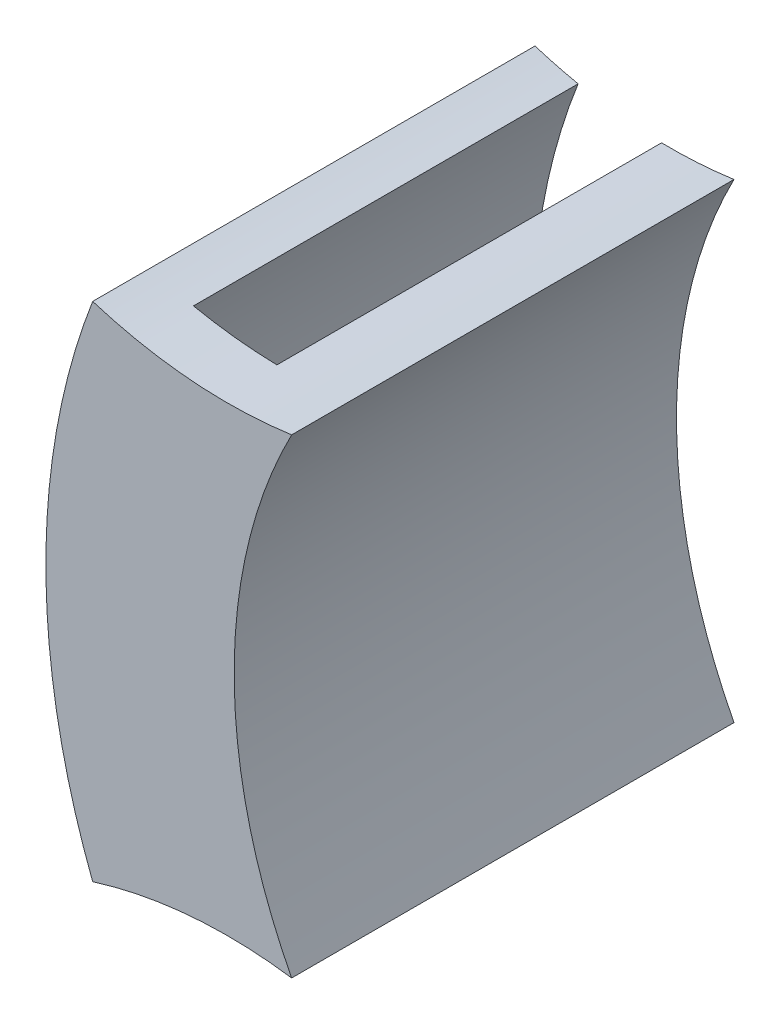
ISO-10303-21;
HEADER;
FILE_DESCRIPTION(('STEP AP214'),'2;1');
FILE_NAME('part.step','',(''),(''),'','','');
FILE_SCHEMA(('AUTOMOTIVE_DESIGN { 1 0 10303 214 1 1 1 1 }'));
ENDSEC;
DATA;
#1=APPLICATION_CONTEXT('core data for automotive mechanical design processes');
#2=APPLICATION_PROTOCOL_DEFINITION('international standard','automotive_design',2000,#1);
#3=PRODUCT_CONTEXT('',#1,'mechanical');
#4=PRODUCT('Part','Part','',(#3));
#5=PRODUCT_RELATED_PRODUCT_CATEGORY('part','',(#4));
#6=PRODUCT_DEFINITION_FORMATION('','',#4);
#7=PRODUCT_DEFINITION_CONTEXT('part definition',#1,'design');
#8=PRODUCT_DEFINITION('design','',#6,#7);
#9=PRODUCT_DEFINITION_SHAPE('','',#8);
#10=(LENGTH_UNIT() NAMED_UNIT(*) SI_UNIT(.MILLI.,.METRE.));
#11=(NAMED_UNIT(*) PLANE_ANGLE_UNIT() SI_UNIT($,.RADIAN.));
#12=(NAMED_UNIT(*) SI_UNIT($,.STERADIAN.) SOLID_ANGLE_UNIT());
#13=UNCERTAINTY_MEASURE_WITH_UNIT(LENGTH_MEASURE(1.E-05),#10,'distance_accuracy_value','');
#14=(GEOMETRIC_REPRESENTATION_CONTEXT(3) GLOBAL_UNCERTAINTY_ASSIGNED_CONTEXT((#13)) GLOBAL_UNIT_ASSIGNED_CONTEXT((#10,
#11,#12)) REPRESENTATION_CONTEXT('',''));
#15=CARTESIAN_POINT('',(0.,0.,0.));
#16=DIRECTION('',(0.,0.,1.));
#17=DIRECTION('',(1.,0.,0.));
#18=AXIS2_PLACEMENT_3D('',#15,#16,#17);
#19=CARTESIAN_POINT('',(48.9161574122511,-17.7463960572423,0.));
#20=DIRECTION('',(0.,0.,-1.));
#21=DIRECTION('',(-1.,0.,0.));
#22=AXIS2_PLACEMENT_3D('',#19,#20,#21);
#23=PLANE('',#22);
#24=CARTESIAN_POINT('',(35.495372412122,-35.4927921144832,0.));
#25=DIRECTION('',(0.,0.,-1.));
#26=DIRECTION('',(-1.,0.,0.));
#27=AXIS2_PLACEMENT_3D('',#24,#25,#26);
#28=CIRCLE('',#27,23.5);
#29=CARTESIAN_POINT('',(30.7185308439335,-12.483407406664,0.));
#30=VERTEX_POINT('',#29);
#31=CARTESIAN_POINT('',(35.0582387965622,-11.9968581215102,0.));
#32=VERTEX_POINT('',#31);
#33=EDGE_CURVE('E63',#30,#32,#28,.T.);
#34=ORIENTED_EDGE('',*,*,#33,.F.);
#35=CARTESIAN_POINT('',(62.3369424123802,-1.36316515455459E-12,0.));
#36=DIRECTION('',(0.,0.,1.));
#37=DIRECTION('',(-1.,0.,0.));
#38=AXIS2_PLACEMENT_3D('',#35,#36,#37);
#39=CIRCLE('',#38,33.9935201265242);
#40=CARTESIAN_POINT('',(30.7185308439352,12.4834074066655,0.));
#41=VERTEX_POINT('',#40);
#42=EDGE_CURVE('E133',#41,#30,#39,.T.);
#43=ORIENTED_EDGE('',*,*,#42,.F.);
#44=CARTESIAN_POINT('',(35.4953724121268,35.4927921144842,0.));
#45=DIRECTION('',(0.,0.,-1.));
#46=DIRECTION('',(-1.,0.,0.));
#47=AXIS2_PLACEMENT_3D('',#44,#45,#46);
#48=CIRCLE('',#47,23.5);
#49=CARTESIAN_POINT('',(35.0582387965638,11.9968581215111,0.));
#50=VERTEX_POINT('',#49);
#51=EDGE_CURVE('E176',#50,#41,#48,.T.);
#52=ORIENTED_EDGE('',*,*,#51,.F.);
#53=CARTESIAN_POINT('',(62.3369424123802,-1.36316515455459E-12,0.));
#54=DIRECTION('',(0.,0.,-1.));
#55=DIRECTION('',(1.,0.,0.));
#56=AXIS2_PLACEMENT_3D('',#53,#54,#55);
#57=CIRCLE('',#56,29.8002059682019);
#58=EDGE_CURVE('E147',#32,#50,#57,.T.);
#59=ORIENTED_EDGE('',*,*,#58,.F.);
#60=EDGE_LOOP('',(#34,#43,#52,#59));
#61=FACE_BOUND('',#60,.T.);
#62=ADVANCED_FACE('F39',(#61),#23,.T.);
#63=CARTESIAN_POINT('',(35.495372412122,-35.4927921144832,3.));
#64=DIRECTION('',(0.,0.,-1.));
#65=DIRECTION('',(-1.,0.,0.));
#66=AXIS2_PLACEMENT_3D('',#63,#64,#65);
#67=CYLINDRICAL_SURFACE('',#66,23.5);
#68=DIRECTION('',(0.,0.,-1.));
#69=VECTOR('',#68,1.);
#70=CARTESIAN_POINT('',(28.4767119122256,-13.06538912646,3.));
#71=LINE('',#70,#69);
#72=CARTESIAN_POINT('',(28.4767119122256,-13.06538912646,3.));
#73=VERTEX_POINT('',#72);
#74=CARTESIAN_POINT('',(28.4767119122256,-13.06538912646,-20.));
#75=VERTEX_POINT('',#74);
#76=EDGE_CURVE('E107',#73,#75,#71,.T.);
#77=ORIENTED_EDGE('',*,*,#76,.T.);
#78=CARTESIAN_POINT('',(35.4953724121276,-35.4927921145061,-20.));
#79=DIRECTION('',(0.,0.,1.));
#80=DIRECTION('',(-1.,0.,0.));
#81=AXIS2_PLACEMENT_3D('',#78,#79,#80);
#82=CIRCLE('',#81,23.5000000000235);
#83=CARTESIAN_POINT('',(30.7185308439335,-12.483407406664,-20.));
#84=VERTEX_POINT('',#83);
#85=EDGE_CURVE('E110',#84,#75,#82,.T.);
#86=ORIENTED_EDGE('',*,*,#85,.F.);
#87=DIRECTION('',(0.,0.,1.));
#88=VECTOR('',#87,1.);
#89=CARTESIAN_POINT('',(30.7185308439335,-12.483407406664,-20.));
#90=LINE('',#89,#88);
#91=EDGE_CURVE('E141',#84,#30,#90,.T.);
#92=ORIENTED_EDGE('',*,*,#91,.T.);
#93=ORIENTED_EDGE('',*,*,#33,.T.);
#94=DIRECTION('',(0.,0.,1.));
#95=VECTOR('',#94,1.);
#96=CARTESIAN_POINT('',(35.0582387965622,-11.9968581215102,-20.));
#97=LINE('',#96,#95);
#98=CARTESIAN_POINT('',(35.0582387965622,-11.9968581215102,-20.));
#99=VERTEX_POINT('',#98);
#100=EDGE_CURVE('E169',#99,#32,#97,.T.);
#101=ORIENTED_EDGE('',*,*,#100,.F.);
#102=CARTESIAN_POINT('',(35.4953724121219,-35.4927921144871,-20.));
#103=DIRECTION('',(0.,0.,1.));
#104=DIRECTION('',(1.,0.,0.));
#105=AXIS2_PLACEMENT_3D('',#102,#103,#104);
#106=CIRCLE('',#105,23.5000000000039);
#107=CARTESIAN_POINT('',(38.8239963532031,-12.2297256214591,-20.));
#108=VERTEX_POINT('',#107);
#109=EDGE_CURVE('E156',#108,#99,#106,.T.);
#110=ORIENTED_EDGE('',*,*,#109,.F.);
#111=DIRECTION('',(0.,0.,-1.));
#112=VECTOR('',#111,1.);
#113=CARTESIAN_POINT('',(38.8239963532031,-12.2297256214591,3.));
#114=LINE('',#113,#112);
#115=CARTESIAN_POINT('',(38.8239963532031,-12.2297256214591,3.));
#116=VERTEX_POINT('',#115);
#117=EDGE_CURVE('E11',#116,#108,#114,.T.);
#118=ORIENTED_EDGE('',*,*,#117,.F.);
#119=CARTESIAN_POINT('',(35.495372412122,-35.4927921144832,3.));
#120=DIRECTION('',(0.,0.,-1.));
#121=DIRECTION('',(-1.,0.,0.));
#122=AXIS2_PLACEMENT_3D('',#119,#120,#121);
#123=CIRCLE('',#122,23.5);
#124=EDGE_CURVE('E113',#73,#116,#123,.T.);
#125=ORIENTED_EDGE('',*,*,#124,.F.);
#126=EDGE_LOOP('',(#77,#86,#92,#93,#101,#110,#118,#125));
#127=FACE_BOUND('',#126,.T.);
#128=ADVANCED_FACE('F41',(#127),#67,.F.);
#129=CARTESIAN_POINT('',(62.3369424123802,-1.37715669691003E-12,3.));
#130=DIRECTION('',(0.,0.,-1.));
#131=DIRECTION('',(-1.,0.,0.));
#132=AXIS2_PLACEMENT_3D('',#129,#130,#131);
#133=CYLINDRICAL_SURFACE('',#132,26.5032983071525);
#134=ORIENTED_EDGE('',*,*,#117,.T.);
#135=CARTESIAN_POINT('',(62.3369424123802,-1.36316515455459E-12,-20.));
#136=DIRECTION('',(0.,0.,1.));
#137=DIRECTION('',(1.,0.,0.));
#138=AXIS2_PLACEMENT_3D('',#135,#136,#137);
#139=CIRCLE('',#138,26.5032983071524);
#140=CARTESIAN_POINT('',(38.8239963532048,12.2297256214596,-20.));
#141=VERTEX_POINT('',#140);
#142=EDGE_CURVE('E152',#141,#108,#139,.T.);
#143=ORIENTED_EDGE('',*,*,#142,.F.);
#144=DIRECTION('',(0.,0.,-1.));
#145=VECTOR('',#144,1.);
#146=CARTESIAN_POINT('',(38.8239963532048,12.2297256214596,3.));
#147=LINE('',#146,#145);
#148=CARTESIAN_POINT('',(38.8239963532048,12.2297256214596,3.));
#149=VERTEX_POINT('',#148);
#150=EDGE_CURVE('E48',#149,#141,#147,.T.);
#151=ORIENTED_EDGE('',*,*,#150,.F.);
#152=CARTESIAN_POINT('',(62.3369424123802,-1.37715669691003E-12,3.));
#153=DIRECTION('',(0.,0.,-1.));
#154=DIRECTION('',(-1.,0.,0.));
#155=AXIS2_PLACEMENT_3D('',#152,#153,#154);
#156=CIRCLE('',#155,26.5032983071525);
#157=EDGE_CURVE('E175',#116,#149,#156,.T.);
#158=ORIENTED_EDGE('',*,*,#157,.F.);
#159=EDGE_LOOP('',(#134,#143,#151,#158));
#160=FACE_BOUND('',#159,.T.);
#161=ADVANCED_FACE('F198',(#160),#133,.F.);
#162=CARTESIAN_POINT('',(35.4953724121268,35.4927921144842,3.));
#163=DIRECTION('',(0.,0.,-1.));
#164=DIRECTION('',(-1.,0.,0.));
#165=AXIS2_PLACEMENT_3D('',#162,#163,#164);
#166=CYLINDRICAL_SURFACE('',#165,23.5);
#167=ORIENTED_EDGE('',*,*,#150,.T.);
#168=CARTESIAN_POINT('',(35.495372412126,35.4927921144982,-20.));
#169=DIRECTION('',(0.,0.,1.));
#170=DIRECTION('',(-1.,0.,0.));
#171=AXIS2_PLACEMENT_3D('',#168,#169,#170);
#172=CIRCLE('',#171,23.500000000014);
#173=CARTESIAN_POINT('',(35.0582387965638,11.9968581215111,-20.));
#174=VERTEX_POINT('',#173);
#175=EDGE_CURVE('E148',#174,#141,#172,.T.);
#176=ORIENTED_EDGE('',*,*,#175,.F.);
#177=DIRECTION('',(0.,0.,1.));
#178=VECTOR('',#177,1.);
#179=CARTESIAN_POINT('',(35.0582387965638,11.9968581215111,-20.));
#180=LINE('',#179,#178);
#181=EDGE_CURVE('E162',#174,#50,#180,.T.);
#182=ORIENTED_EDGE('',*,*,#181,.T.);
#183=ORIENTED_EDGE('',*,*,#51,.T.);
#184=DIRECTION('',(0.,0.,1.));
#185=VECTOR('',#184,1.);
#186=CARTESIAN_POINT('',(30.7185308439352,12.4834074066655,-20.));
#187=LINE('',#186,#185);
#188=CARTESIAN_POINT('',(30.7185308439352,12.4834074066655,-20.));
#189=VERTEX_POINT('',#188);
#190=EDGE_CURVE('E55',#189,#41,#187,.T.);
#191=ORIENTED_EDGE('',*,*,#190,.F.);
#192=CARTESIAN_POINT('',(35.4953724121422,35.4927921145435,-20.));
#193=DIRECTION('',(0.,0.,1.));
#194=DIRECTION('',(-1.,0.,0.));
#195=AXIS2_PLACEMENT_3D('',#192,#193,#194);
#196=CIRCLE('',#195,23.5000000000613);
#197=CARTESIAN_POINT('',(28.4767119122273,13.0653891264618,-20.));
#198=VERTEX_POINT('',#197);
#199=EDGE_CURVE('E127',#198,#189,#196,.T.);
#200=ORIENTED_EDGE('',*,*,#199,.F.);
#201=DIRECTION('',(0.,0.,-1.));
#202=VECTOR('',#201,1.);
#203=CARTESIAN_POINT('',(28.4767119122273,13.0653891264618,3.));
#204=LINE('',#203,#202);
#205=CARTESIAN_POINT('',(28.4767119122273,13.0653891264618,3.));
#206=VERTEX_POINT('',#205);
#207=EDGE_CURVE('E117',#206,#198,#204,.T.);
#208=ORIENTED_EDGE('',*,*,#207,.F.);
#209=CARTESIAN_POINT('',(35.4953724121268,35.4927921144842,3.));
#210=DIRECTION('',(0.,0.,-1.));
#211=DIRECTION('',(-1.,0.,0.));
#212=AXIS2_PLACEMENT_3D('',#209,#210,#211);
#213=CIRCLE('',#212,23.5);
#214=EDGE_CURVE('E179',#149,#206,#213,.T.);
#215=ORIENTED_EDGE('',*,*,#214,.F.);
#216=EDGE_LOOP('',(#167,#176,#182,#183,#191,#200,#208,#215));
#217=FACE_BOUND('',#216,.T.);
#218=ADVANCED_FACE('F196',(#217),#166,.F.);
#219=CARTESIAN_POINT('',(62.3369424123802,-1.37715669691003E-12,3.));
#220=DIRECTION('',(0.,0.,-1.));
#221=DIRECTION('',(-1.,0.,0.));
#222=AXIS2_PLACEMENT_3D('',#219,#220,#221);
#223=CYLINDRICAL_SURFACE('',#222,36.2935201179134);
#224=ORIENTED_EDGE('',*,*,#207,.T.);
#225=CARTESIAN_POINT('',(62.3369424123802,-1.36316515455459E-12,-20.));
#226=DIRECTION('',(0.,0.,-1.));
#227=DIRECTION('',(1.,0.,0.));
#228=AXIS2_PLACEMENT_3D('',#225,#226,#227);
#229=CIRCLE('',#228,36.2935201179134);
#230=EDGE_CURVE('E121',#75,#198,#229,.T.);
#231=ORIENTED_EDGE('',*,*,#230,.F.);
#232=ORIENTED_EDGE('',*,*,#76,.F.);
#233=CARTESIAN_POINT('',(62.3369424123802,-1.37715669691003E-12,3.));
#234=DIRECTION('',(0.,0.,1.));
#235=DIRECTION('',(-1.,0.,0.));
#236=AXIS2_PLACEMENT_3D('',#233,#234,#235);
#237=CIRCLE('',#236,36.2935201179134);
#238=EDGE_CURVE('E118',#206,#73,#237,.T.);
#239=ORIENTED_EDGE('',*,*,#238,.F.);
#240=EDGE_LOOP('',(#224,#231,#232,#239));
#241=FACE_BOUND('',#240,.T.);
#242=ADVANCED_FACE('F122',(#241),#223,.T.);
#243=CARTESIAN_POINT('',(48.9161574122511,-17.7463960572423,3.));
#244=DIRECTION('',(0.,0.,-1.));
#245=DIRECTION('',(-1.,0.,0.));
#246=AXIS2_PLACEMENT_3D('',#243,#244,#245);
#247=PLANE('',#246);
#248=ORIENTED_EDGE('',*,*,#124,.T.);
#249=ORIENTED_EDGE('',*,*,#157,.T.);
#250=ORIENTED_EDGE('',*,*,#214,.T.);
#251=ORIENTED_EDGE('',*,*,#238,.T.);
#252=EDGE_LOOP('',(#248,#249,#250,#251));
#253=FACE_BOUND('',#252,.T.);
#254=ADVANCED_FACE('F223',(#253),#247,.F.);
#255=CARTESIAN_POINT('',(62.3369424123802,-1.36316515455459E-12,-20.));
#256=DIRECTION('',(0.,0.,1.));
#257=DIRECTION('',(1.,0.,0.));
#258=AXIS2_PLACEMENT_3D('',#255,#256,#257);
#259=CYLINDRICAL_SURFACE('',#258,29.8002059682019);
#260=ORIENTED_EDGE('',*,*,#58,.T.);
#261=ORIENTED_EDGE('',*,*,#181,.F.);
#262=CARTESIAN_POINT('',(62.3369424123802,-1.36316515455459E-12,-20.));
#263=DIRECTION('',(0.,0.,-1.));
#264=DIRECTION('',(1.,0.,0.));
#265=AXIS2_PLACEMENT_3D('',#262,#263,#264);
#266=CIRCLE('',#265,29.8002059682019);
#267=EDGE_CURVE('E159',#99,#174,#266,.T.);
#268=ORIENTED_EDGE('',*,*,#267,.F.);
#269=ORIENTED_EDGE('',*,*,#100,.T.);
#270=EDGE_LOOP('',(#260,#261,#268,#269));
#271=FACE_BOUND('',#270,.T.);
#272=ADVANCED_FACE('F205',(#271),#259,.T.);
#273=CARTESIAN_POINT('',(48.9161574122531,17.7463960572484,-20.));
#274=DIRECTION('',(0.,0.,-1.));
#275=DIRECTION('',(-1.,0.,0.));
#276=AXIS2_PLACEMENT_3D('',#273,#274,#275);
#277=PLANE('',#276);
#278=ORIENTED_EDGE('',*,*,#175,.T.);
#279=ORIENTED_EDGE('',*,*,#142,.T.);
#280=ORIENTED_EDGE('',*,*,#109,.T.);
#281=ORIENTED_EDGE('',*,*,#267,.T.);
#282=EDGE_LOOP('',(#278,#279,#280,#281));
#283=FACE_BOUND('',#282,.T.);
#284=ADVANCED_FACE('F201',(#283),#277,.T.);
#285=CARTESIAN_POINT('',(62.3369424123802,-1.36316515455459E-12,-20.));
#286=DIRECTION('',(0.,0.,1.));
#287=DIRECTION('',(1.,0.,0.));
#288=AXIS2_PLACEMENT_3D('',#285,#286,#287);
#289=CYLINDRICAL_SURFACE('',#288,33.9935201265242);
#290=ORIENTED_EDGE('',*,*,#42,.T.);
#291=ORIENTED_EDGE('',*,*,#91,.F.);
#292=CARTESIAN_POINT('',(62.3369424123802,-1.36316515455459E-12,-20.));
#293=DIRECTION('',(0.,0.,1.));
#294=DIRECTION('',(-1.,0.,0.));
#295=AXIS2_PLACEMENT_3D('',#292,#293,#294);
#296=CIRCLE('',#295,33.9935201265242);
#297=EDGE_CURVE('E130',#189,#84,#296,.T.);
#298=ORIENTED_EDGE('',*,*,#297,.F.);
#299=ORIENTED_EDGE('',*,*,#190,.T.);
#300=EDGE_LOOP('',(#290,#291,#298,#299));
#301=FACE_BOUND('',#300,.T.);
#302=ADVANCED_FACE('F207',(#301),#289,.F.);
#303=CARTESIAN_POINT('',(48.9161574122539,-17.7463960572537,-20.));
#304=DIRECTION('',(0.,0.,-1.));
#305=DIRECTION('',(-1.,0.,0.));
#306=AXIS2_PLACEMENT_3D('',#303,#304,#305);
#307=PLANE('',#306);
#308=ORIENTED_EDGE('',*,*,#85,.T.);
#309=ORIENTED_EDGE('',*,*,#230,.T.);
#310=ORIENTED_EDGE('',*,*,#199,.T.);
#311=ORIENTED_EDGE('',*,*,#297,.T.);
#312=EDGE_LOOP('',(#308,#309,#310,#311));
#313=FACE_BOUND('',#312,.T.);
#314=ADVANCED_FACE('F129',(#313),#307,.T.);
#315=CLOSED_SHELL('',(#62,#128,#161,#218,#242,#254,#272,#284,#302,#314));
#316=MANIFOLD_SOLID_BREP('B2',#315);
#317=ADVANCED_BREP_SHAPE_REPRESENTATION('',(#18,#316),#14);
#318=SHAPE_DEFINITION_REPRESENTATION(#9,#317);
ENDSEC;
END-ISO-10303-21;
